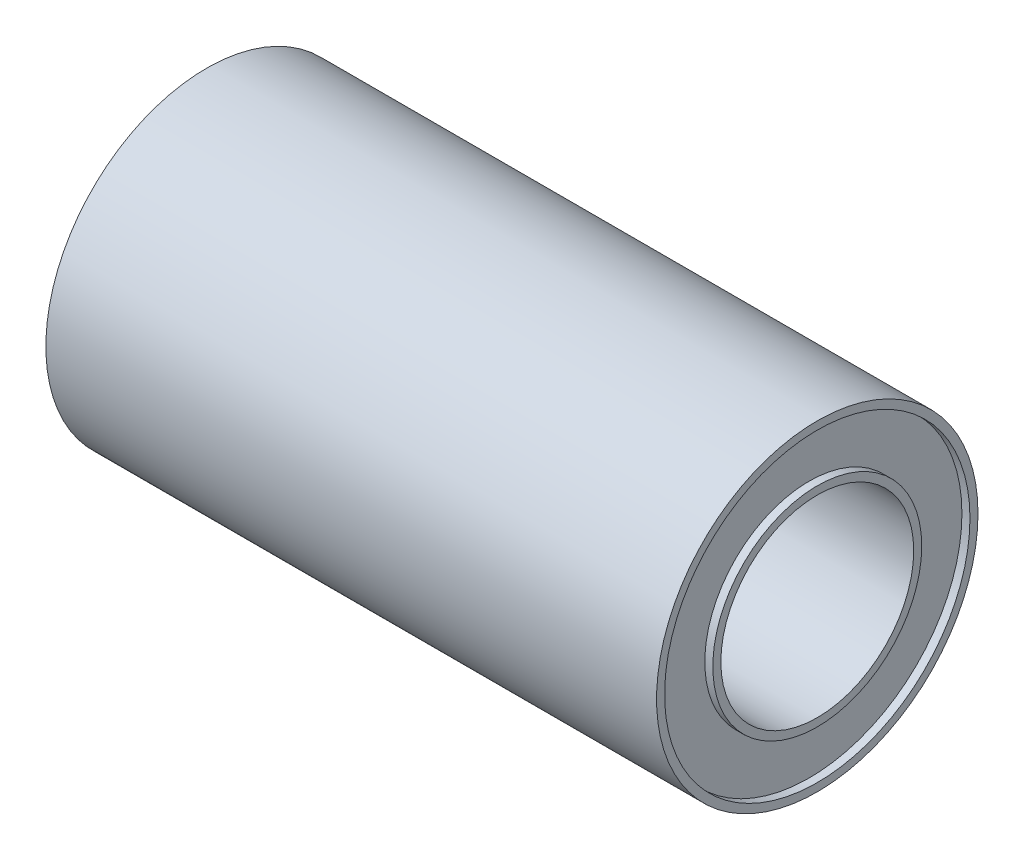
ISO-10303-21;
HEADER;
FILE_DESCRIPTION(('STEP AP214'),'2;1');
FILE_NAME('part.step','',(''),(''),'','','');
FILE_SCHEMA(('AUTOMOTIVE_DESIGN { 1 0 10303 214 1 1 1 1 }'));
ENDSEC;
DATA;
#1=APPLICATION_CONTEXT('core data for automotive mechanical design processes');
#2=APPLICATION_PROTOCOL_DEFINITION('international standard','automotive_design',2000,#1);
#3=PRODUCT_CONTEXT('',#1,'mechanical');
#4=PRODUCT('Part','Part','',(#3));
#5=PRODUCT_RELATED_PRODUCT_CATEGORY('part','',(#4));
#6=PRODUCT_DEFINITION_FORMATION('','',#4);
#7=PRODUCT_DEFINITION_CONTEXT('part definition',#1,'design');
#8=PRODUCT_DEFINITION('design','',#6,#7);
#9=PRODUCT_DEFINITION_SHAPE('','',#8);
#10=(LENGTH_UNIT() NAMED_UNIT(*) SI_UNIT(.MILLI.,.METRE.));
#11=(NAMED_UNIT(*) PLANE_ANGLE_UNIT() SI_UNIT($,.RADIAN.));
#12=(NAMED_UNIT(*) SI_UNIT($,.STERADIAN.) SOLID_ANGLE_UNIT());
#13=UNCERTAINTY_MEASURE_WITH_UNIT(LENGTH_MEASURE(1.E-05),#10,'distance_accuracy_value','');
#14=(GEOMETRIC_REPRESENTATION_CONTEXT(3) GLOBAL_UNCERTAINTY_ASSIGNED_CONTEXT((#13)) GLOBAL_UNIT_ASSIGNED_CONTEXT((#10,
#11,#12)) REPRESENTATION_CONTEXT('',''));
#15=CARTESIAN_POINT('',(0.,0.,0.));
#16=DIRECTION('',(0.,0.,1.));
#17=DIRECTION('',(1.,0.,0.));
#18=AXIS2_PLACEMENT_3D('',#15,#16,#17);
#19=CARTESIAN_POINT('',(0.,0.,0.));
#20=DIRECTION('',(1.,0.,0.));
#21=DIRECTION('',(0.,0.,-1.));
#22=AXIS2_PLACEMENT_3D('',#19,#20,#21);
#23=PLANE('',#22);
#24=CARTESIAN_POINT('',(0.,0.,0.));
#25=DIRECTION('',(1.,0.,0.));
#26=DIRECTION('',(0.,0.,-1.));
#27=AXIS2_PLACEMENT_3D('',#24,#25,#26);
#28=CIRCLE('',#27,5.);
#29=CARTESIAN_POINT('',(0.,0.,-5.));
#30=VERTEX_POINT('',#29);
#31=EDGE_CURVE('E33',#30,#30,#28,.T.);
#32=ORIENTED_EDGE('',*,*,#31,.F.);
#33=EDGE_LOOP('',(#32));
#34=FACE_BOUND('',#33,.T.);
#35=CARTESIAN_POINT('',(0.,0.,0.));
#36=DIRECTION('',(1.,0.,0.));
#37=DIRECTION('',(0.,0.,-1.));
#38=AXIS2_PLACEMENT_3D('',#35,#36,#37);
#39=CIRCLE('',#38,4.75);
#40=CARTESIAN_POINT('',(0.,0.,-4.75));
#41=VERTEX_POINT('',#40);
#42=EDGE_CURVE('E60',#41,#41,#39,.T.);
#43=ORIENTED_EDGE('',*,*,#42,.T.);
#44=EDGE_LOOP('',(#43));
#45=FACE_BOUND('',#44,.T.);
#46=ADVANCED_FACE('F29',(#34,#45),#23,.F.);
#47=CARTESIAN_POINT('',(19.,0.,0.));
#48=DIRECTION('',(1.,0.,0.));
#49=DIRECTION('',(0.,0.,-1.));
#50=AXIS2_PLACEMENT_3D('',#47,#48,#49);
#51=PLANE('',#50);
#52=CARTESIAN_POINT('',(19.,0.,0.));
#53=DIRECTION('',(1.,0.,0.));
#54=DIRECTION('',(0.,0.,-1.));
#55=AXIS2_PLACEMENT_3D('',#52,#53,#54);
#56=CIRCLE('',#55,3.);
#57=CARTESIAN_POINT('',(19.,0.,-3.));
#58=VERTEX_POINT('',#57);
#59=EDGE_CURVE('E40',#58,#58,#56,.T.);
#60=ORIENTED_EDGE('',*,*,#59,.F.);
#61=EDGE_LOOP('',(#60));
#62=FACE_BOUND('',#61,.T.);
#63=CARTESIAN_POINT('',(19.,0.,0.));
#64=DIRECTION('',(1.,0.,0.));
#65=DIRECTION('',(0.,0.,-1.));
#66=AXIS2_PLACEMENT_3D('',#63,#64,#65);
#67=CIRCLE('',#66,3.25);
#68=CARTESIAN_POINT('',(19.,0.,-3.25));
#69=VERTEX_POINT('',#68);
#70=EDGE_CURVE('E54',#69,#69,#67,.T.);
#71=ORIENTED_EDGE('',*,*,#70,.T.);
#72=EDGE_LOOP('',(#71));
#73=FACE_BOUND('',#72,.T.);
#74=ADVANCED_FACE('F102',(#62,#73),#51,.T.);
#75=CARTESIAN_POINT('',(19.,0.,0.));
#76=DIRECTION('',(1.,0.,0.));
#77=DIRECTION('',(0.,0.,-1.));
#78=AXIS2_PLACEMENT_3D('',#75,#76,#77);
#79=CIRCLE('',#78,4.75);
#80=CARTESIAN_POINT('',(19.,0.,-4.75));
#81=VERTEX_POINT('',#80);
#82=EDGE_CURVE('E48',#81,#81,#79,.T.);
#83=ORIENTED_EDGE('',*,*,#82,.F.);
#84=EDGE_LOOP('',(#83));
#85=FACE_BOUND('',#84,.T.);
#86=CARTESIAN_POINT('',(19.,0.,0.));
#87=DIRECTION('',(1.,0.,0.));
#88=DIRECTION('',(0.,0.,-1.));
#89=AXIS2_PLACEMENT_3D('',#86,#87,#88);
#90=CIRCLE('',#89,5.);
#91=CARTESIAN_POINT('',(19.,0.,-5.));
#92=VERTEX_POINT('',#91);
#93=EDGE_CURVE('E10',#92,#92,#90,.T.);
#94=ORIENTED_EDGE('',*,*,#93,.T.);
#95=EDGE_LOOP('',(#94));
#96=FACE_BOUND('',#95,.T.);
#97=ADVANCED_FACE('F84',(#85,#96),#51,.T.);
#98=CARTESIAN_POINT('',(0.,0.,0.));
#99=DIRECTION('',(1.,0.,0.));
#100=DIRECTION('',(0.,0.,-1.));
#101=AXIS2_PLACEMENT_3D('',#98,#99,#100);
#102=CIRCLE('',#101,3.25);
#103=CARTESIAN_POINT('',(0.,0.,-3.25));
#104=VERTEX_POINT('',#103);
#105=EDGE_CURVE('E66',#104,#104,#102,.T.);
#106=ORIENTED_EDGE('',*,*,#105,.F.);
#107=EDGE_LOOP('',(#106));
#108=FACE_BOUND('',#107,.T.);
#109=CARTESIAN_POINT('',(0.,0.,0.));
#110=DIRECTION('',(1.,0.,0.));
#111=DIRECTION('',(0.,0.,-1.));
#112=AXIS2_PLACEMENT_3D('',#109,#110,#111);
#113=CIRCLE('',#112,3.);
#114=CARTESIAN_POINT('',(0.,0.,-3.));
#115=VERTEX_POINT('',#114);
#116=EDGE_CURVE('E42',#115,#115,#113,.T.);
#117=ORIENTED_EDGE('',*,*,#116,.T.);
#118=EDGE_LOOP('',(#117));
#119=FACE_BOUND('',#118,.T.);
#120=ADVANCED_FACE('F81',(#108,#119),#23,.F.);
#121=CARTESIAN_POINT('',(19.,0.,0.));
#122=DIRECTION('',(-1.,0.,0.));
#123=DIRECTION('',(0.,0.,1.));
#124=AXIS2_PLACEMENT_3D('',#121,#122,#123);
#125=CYLINDRICAL_SURFACE('',#124,5.);
#126=ORIENTED_EDGE('',*,*,#93,.F.);
#127=EDGE_LOOP('',(#126));
#128=FACE_BOUND('',#127,.T.);
#129=ORIENTED_EDGE('',*,*,#31,.T.);
#130=EDGE_LOOP('',(#129));
#131=FACE_BOUND('',#130,.T.);
#132=ADVANCED_FACE('F31',(#128,#131),#125,.T.);
#133=CARTESIAN_POINT('',(19.,0.,0.));
#134=DIRECTION('',(-1.,0.,0.));
#135=DIRECTION('',(0.,0.,1.));
#136=AXIS2_PLACEMENT_3D('',#133,#134,#135);
#137=CYLINDRICAL_SURFACE('',#136,3.);
#138=ORIENTED_EDGE('',*,*,#59,.T.);
#139=EDGE_LOOP('',(#138));
#140=FACE_BOUND('',#139,.T.);
#141=ORIENTED_EDGE('',*,*,#116,.F.);
#142=EDGE_LOOP('',(#141));
#143=FACE_BOUND('',#142,.T.);
#144=ADVANCED_FACE('F87',(#140,#143),#137,.F.);
#145=CARTESIAN_POINT('',(18.75,0.,0.));
#146=DIRECTION('',(1.,0.,0.));
#147=DIRECTION('',(0.,0.,-1.));
#148=AXIS2_PLACEMENT_3D('',#145,#146,#147);
#149=CYLINDRICAL_SURFACE('',#148,4.75);
#150=CARTESIAN_POINT('',(18.75,0.,0.));
#151=DIRECTION('',(1.,0.,0.));
#152=DIRECTION('',(0.,0.,-1.));
#153=AXIS2_PLACEMENT_3D('',#150,#151,#152);
#154=CIRCLE('',#153,4.75);
#155=CARTESIAN_POINT('',(18.75,0.,-4.75));
#156=VERTEX_POINT('',#155);
#157=EDGE_CURVE('E45',#156,#156,#154,.T.);
#158=ORIENTED_EDGE('',*,*,#157,.F.);
#159=EDGE_LOOP('',(#158));
#160=FACE_BOUND('',#159,.T.);
#161=ORIENTED_EDGE('',*,*,#82,.T.);
#162=EDGE_LOOP('',(#161));
#163=FACE_BOUND('',#162,.T.);
#164=ADVANCED_FACE('F89',(#160,#163),#149,.F.);
#165=CARTESIAN_POINT('',(18.75,0.,0.));
#166=DIRECTION('',(1.,0.,0.));
#167=DIRECTION('',(0.,0.,-1.));
#168=AXIS2_PLACEMENT_3D('',#165,#166,#167);
#169=PLANE('',#168);
#170=CARTESIAN_POINT('',(18.75,0.,0.));
#171=DIRECTION('',(1.,0.,0.));
#172=DIRECTION('',(0.,0.,-1.));
#173=AXIS2_PLACEMENT_3D('',#170,#171,#172);
#174=CIRCLE('',#173,3.25);
#175=CARTESIAN_POINT('',(18.75,0.,-3.25));
#176=VERTEX_POINT('',#175);
#177=EDGE_CURVE('E51',#176,#176,#174,.T.);
#178=ORIENTED_EDGE('',*,*,#177,.F.);
#179=EDGE_LOOP('',(#178));
#180=FACE_BOUND('',#179,.T.);
#181=ORIENTED_EDGE('',*,*,#157,.T.);
#182=EDGE_LOOP('',(#181));
#183=FACE_BOUND('',#182,.T.);
#184=ADVANCED_FACE('F96',(#180,#183),#169,.T.);
#185=CARTESIAN_POINT('',(18.75,0.,0.));
#186=DIRECTION('',(1.,0.,0.));
#187=DIRECTION('',(0.,0.,-1.));
#188=AXIS2_PLACEMENT_3D('',#185,#186,#187);
#189=CYLINDRICAL_SURFACE('',#188,3.25);
#190=ORIENTED_EDGE('',*,*,#177,.T.);
#191=EDGE_LOOP('',(#190));
#192=FACE_BOUND('',#191,.T.);
#193=ORIENTED_EDGE('',*,*,#70,.F.);
#194=EDGE_LOOP('',(#193));
#195=FACE_BOUND('',#194,.T.);
#196=ADVANCED_FACE('F150',(#192,#195),#189,.T.);
#197=CARTESIAN_POINT('',(0.25,0.,0.));
#198=DIRECTION('',(-1.,0.,0.));
#199=DIRECTION('',(0.,0.,-1.));
#200=AXIS2_PLACEMENT_3D('',#197,#198,#199);
#201=PLANE('',#200);
#202=CARTESIAN_POINT('',(0.25,0.,0.));
#203=DIRECTION('',(1.,0.,0.));
#204=DIRECTION('',(0.,0.,-1.));
#205=AXIS2_PLACEMENT_3D('',#202,#203,#204);
#206=CIRCLE('',#205,4.75);
#207=CARTESIAN_POINT('',(0.25,0.,-4.75));
#208=VERTEX_POINT('',#207);
#209=EDGE_CURVE('E57',#208,#208,#206,.T.);
#210=ORIENTED_EDGE('',*,*,#209,.F.);
#211=EDGE_LOOP('',(#210));
#212=FACE_BOUND('',#211,.T.);
#213=CARTESIAN_POINT('',(0.25,0.,0.));
#214=DIRECTION('',(1.,0.,0.));
#215=DIRECTION('',(0.,0.,-1.));
#216=AXIS2_PLACEMENT_3D('',#213,#214,#215);
#217=CIRCLE('',#216,3.25);
#218=CARTESIAN_POINT('',(0.25,0.,-3.25));
#219=VERTEX_POINT('',#218);
#220=EDGE_CURVE('E63',#219,#219,#217,.T.);
#221=ORIENTED_EDGE('',*,*,#220,.T.);
#222=EDGE_LOOP('',(#221));
#223=FACE_BOUND('',#222,.T.);
#224=ADVANCED_FACE('F72',(#212,#223),#201,.T.);
#225=CARTESIAN_POINT('',(0.25,0.,0.));
#226=DIRECTION('',(-1.,0.,0.));
#227=DIRECTION('',(0.,0.,1.));
#228=AXIS2_PLACEMENT_3D('',#225,#226,#227);
#229=CYLINDRICAL_SURFACE('',#228,4.75);
#230=ORIENTED_EDGE('',*,*,#209,.T.);
#231=EDGE_LOOP('',(#230));
#232=FACE_BOUND('',#231,.T.);
#233=ORIENTED_EDGE('',*,*,#42,.F.);
#234=EDGE_LOOP('',(#233));
#235=FACE_BOUND('',#234,.T.);
#236=ADVANCED_FACE('F77',(#232,#235),#229,.F.);
#237=CARTESIAN_POINT('',(0.25,0.,0.));
#238=DIRECTION('',(-1.,0.,0.));
#239=DIRECTION('',(0.,0.,1.));
#240=AXIS2_PLACEMENT_3D('',#237,#238,#239);
#241=CYLINDRICAL_SURFACE('',#240,3.25);
#242=ORIENTED_EDGE('',*,*,#220,.F.);
#243=EDGE_LOOP('',(#242));
#244=FACE_BOUND('',#243,.T.);
#245=ORIENTED_EDGE('',*,*,#105,.T.);
#246=EDGE_LOOP('',(#245));
#247=FACE_BOUND('',#246,.T.);
#248=ADVANCED_FACE('F74',(#244,#247),#241,.T.);
#249=CLOSED_SHELL('',(#46,#74,#97,#120,#132,#144,#164,#184,#196,#224,#236,#248));
#250=MANIFOLD_SOLID_BREP('B2',#249);
#251=ADVANCED_BREP_SHAPE_REPRESENTATION('',(#18,#250),#14);
#252=SHAPE_DEFINITION_REPRESENTATION(#9,#251);
ENDSEC;
END-ISO-10303-21;
